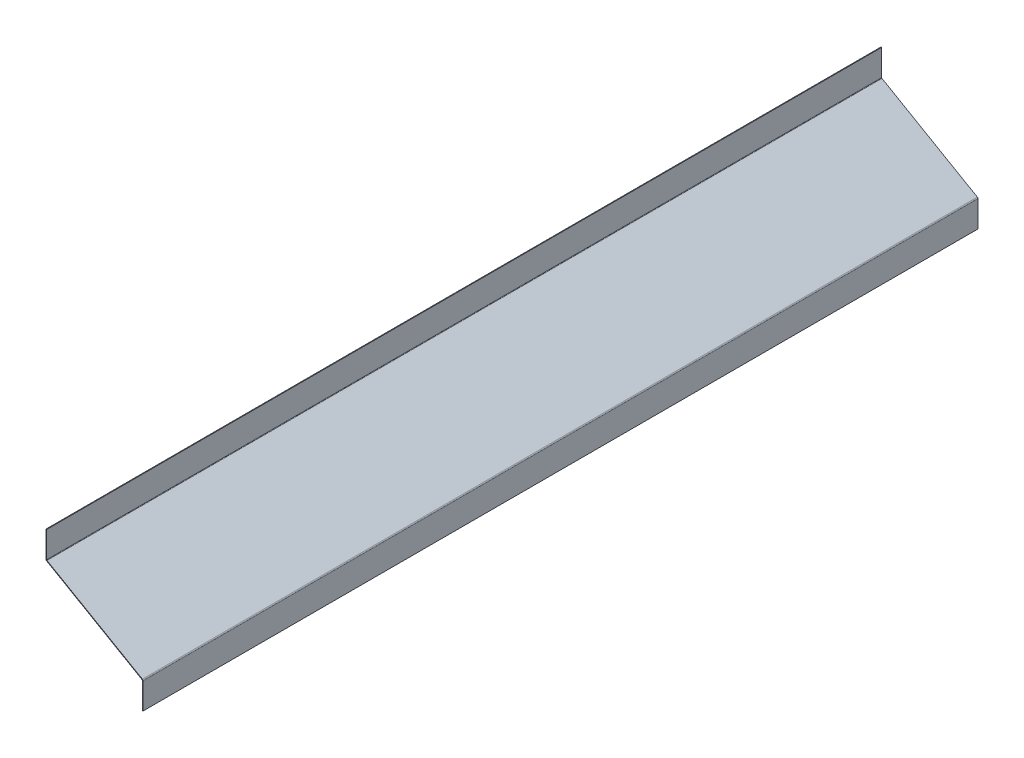
ISO-10303-21;
HEADER;
FILE_DESCRIPTION(('STEP AP214'),'2;1');
FILE_NAME('part.step','',(''),(''),'','','');
FILE_SCHEMA(('AUTOMOTIVE_DESIGN { 1 0 10303 214 1 1 1 1 }'));
ENDSEC;
DATA;
#1=APPLICATION_CONTEXT('core data for automotive mechanical design processes');
#2=APPLICATION_PROTOCOL_DEFINITION('international standard','automotive_design',2000,#1);
#3=PRODUCT_CONTEXT('',#1,'mechanical');
#4=PRODUCT('Part','Part','',(#3));
#5=PRODUCT_RELATED_PRODUCT_CATEGORY('part','',(#4));
#6=PRODUCT_DEFINITION_FORMATION('','',#4);
#7=PRODUCT_DEFINITION_CONTEXT('part definition',#1,'design');
#8=PRODUCT_DEFINITION('design','',#6,#7);
#9=PRODUCT_DEFINITION_SHAPE('','',#8);
#10=(LENGTH_UNIT() NAMED_UNIT(*) SI_UNIT(.MILLI.,.METRE.));
#11=(NAMED_UNIT(*) PLANE_ANGLE_UNIT() SI_UNIT($,.RADIAN.));
#12=(NAMED_UNIT(*) SI_UNIT($,.STERADIAN.) SOLID_ANGLE_UNIT());
#13=UNCERTAINTY_MEASURE_WITH_UNIT(LENGTH_MEASURE(1.E-05),#10,'distance_accuracy_value','');
#14=(GEOMETRIC_REPRESENTATION_CONTEXT(3) GLOBAL_UNCERTAINTY_ASSIGNED_CONTEXT((#13)) GLOBAL_UNIT_ASSIGNED_CONTEXT((#10,
#11,#12)) REPRESENTATION_CONTEXT('',''));
#15=CARTESIAN_POINT('',(0.,0.,0.));
#16=DIRECTION('',(0.,0.,1.));
#17=DIRECTION('',(1.,0.,0.));
#18=AXIS2_PLACEMENT_3D('',#15,#16,#17);
#19=CARTESIAN_POINT('',(0.500000000000002,-0.288675134594812,1242.));
#20=DIRECTION('',(0.,0.,1.));
#21=DIRECTION('',(1.,0.,0.));
#22=AXIS2_PLACEMENT_3D('',#19,#20,#21);
#23=PLANE('',#22);
#24=DIRECTION('',(-0.499999999999998,-0.86602540378444,0.));
#25=VECTOR('',#24,1.);
#26=CARTESIAN_POINT('',(0.500000000000002,-0.288675134594812,1242.));
#27=LINE('',#26,#25);
#28=CARTESIAN_POINT('',(0.500000000000002,-0.288675134594812,1242.));
#29=VERTEX_POINT('',#28);
#30=CARTESIAN_POINT('',(0.,-1.15470053837925,1242.));
#31=VERTEX_POINT('',#30);
#32=EDGE_CURVE('E11',#29,#31,#27,.T.);
#33=ORIENTED_EDGE('',*,*,#32,.F.);
#34=CARTESIAN_POINT('',(1.,0.577350269189627,1242.));
#35=DIRECTION('',(0.,0.,-1.));
#36=DIRECTION('',(-1.,0.,0.));
#37=AXIS2_PLACEMENT_3D('',#34,#35,#36);
#38=CIRCLE('',#37,1.);
#39=CARTESIAN_POINT('',(0.,0.577350269189626,1242.));
#40=VERTEX_POINT('',#39);
#41=EDGE_CURVE('E250',#40,#29,#38,.F.);
#42=ORIENTED_EDGE('',*,*,#41,.F.);
#43=DIRECTION('',(1.,0.,0.));
#44=VECTOR('',#43,1.);
#45=CARTESIAN_POINT('',(-1.,0.577350269189626,1242.));
#46=LINE('',#45,#44);
#47=CARTESIAN_POINT('',(-1.,0.577350269189626,1242.));
#48=VERTEX_POINT('',#47);
#49=EDGE_CURVE('E48',#48,#40,#46,.T.);
#50=ORIENTED_EDGE('',*,*,#49,.F.);
#51=CARTESIAN_POINT('',(1.,0.577350269189627,1242.));
#52=DIRECTION('',(0.,0.,1.));
#53=DIRECTION('',(1.,0.,0.));
#54=AXIS2_PLACEMENT_3D('',#51,#52,#53);
#55=CIRCLE('',#54,2.);
#56=EDGE_CURVE('E149',#48,#31,#55,.T.);
#57=ORIENTED_EDGE('',*,*,#56,.T.);
#58=EDGE_LOOP('',(#33,#42,#50,#57));
#59=FACE_BOUND('',#58,.T.);
#60=ADVANCED_FACE('F40',(#59),#23,.T.);
#61=CARTESIAN_POINT('',(-1.,0.577350269189626,1242.));
#62=DIRECTION('',(0.,0.,1.));
#63=DIRECTION('',(1.,0.,0.));
#64=AXIS2_PLACEMENT_3D('',#61,#62,#63);
#65=PLANE('',#64);
#66=DIRECTION('',(0.86602540378444,-0.499999999999998,0.));
#67=VECTOR('',#66,1.);
#68=CARTESIAN_POINT('',(0.,0.,1242.));
#69=LINE('',#68,#67);
#70=CARTESIAN_POINT('',(142.327204326325,-82.17264973081,1242.));
#71=VERTEX_POINT('',#70);
#72=EDGE_CURVE('E143',#29,#71,#69,.T.);
#73=ORIENTED_EDGE('',*,*,#72,.F.);
#74=ORIENTED_EDGE('',*,*,#32,.T.);
#75=DIRECTION('',(0.86602540378444,-0.499999999999998,0.));
#76=VECTOR('',#75,1.);
#77=CARTESIAN_POINT('',(-0.499999999999998,-0.86602540378444,1242.));
#78=LINE('',#77,#76);
#79=CARTESIAN_POINT('',(141.827204326325,-83.0386751345944,1242.));
#80=VERTEX_POINT('',#79);
#81=EDGE_CURVE('E140',#31,#80,#78,.T.);
#82=ORIENTED_EDGE('',*,*,#81,.T.);
#83=DIRECTION('',(0.499999999999998,0.866025403784439,0.));
#84=VECTOR('',#83,1.);
#85=CARTESIAN_POINT('',(141.827204326325,-83.0386751345944,1242.));
#86=LINE('',#85,#84);
#87=EDGE_CURVE('E231',#80,#71,#86,.T.);
#88=ORIENTED_EDGE('',*,*,#87,.T.);
#89=EDGE_LOOP('',(#73,#74,#82,#88));
#90=FACE_BOUND('',#89,.T.);
#91=ADVANCED_FACE('F138',(#90),#65,.T.);
#92=CARTESIAN_POINT('',(0.,0.577350269189626,0.));
#93=DIRECTION('',(0.,0.,-1.));
#94=DIRECTION('',(-1.,0.,0.));
#95=AXIS2_PLACEMENT_3D('',#92,#93,#94);
#96=PLANE('',#95);
#97=DIRECTION('',(-1.,0.,0.));
#98=VECTOR('',#97,1.);
#99=CARTESIAN_POINT('',(0.,0.577350269189626,0.));
#100=LINE('',#99,#98);
#101=CARTESIAN_POINT('',(0.,0.577350269189626,0.));
#102=VERTEX_POINT('',#101);
#103=CARTESIAN_POINT('',(-1.,0.577350269189626,0.));
#104=VERTEX_POINT('',#103);
#105=EDGE_CURVE('E236',#102,#104,#100,.T.);
#106=ORIENTED_EDGE('',*,*,#105,.F.);
#107=CARTESIAN_POINT('',(1.,0.577350269189627,0.));
#108=DIRECTION('',(0.,0.,-1.));
#109=DIRECTION('',(-1.,0.,0.));
#110=AXIS2_PLACEMENT_3D('',#107,#108,#109);
#111=CIRCLE('',#110,1.);
#112=CARTESIAN_POINT('',(0.500000000000002,-0.288675134594812,0.));
#113=VERTEX_POINT('',#112);
#114=EDGE_CURVE('E188',#102,#113,#111,.F.);
#115=ORIENTED_EDGE('',*,*,#114,.T.);
#116=DIRECTION('',(0.499999999999998,0.86602540378444,0.));
#117=VECTOR('',#116,1.);
#118=CARTESIAN_POINT('',(0.,-1.15470053837925,0.));
#119=LINE('',#118,#117);
#120=CARTESIAN_POINT('',(0.,-1.15470053837925,0.));
#121=VERTEX_POINT('',#120);
#122=EDGE_CURVE('E234',#121,#113,#119,.T.);
#123=ORIENTED_EDGE('',*,*,#122,.F.);
#124=CARTESIAN_POINT('',(1.,0.577350269189627,0.));
#125=DIRECTION('',(0.,0.,1.));
#126=DIRECTION('',(1.,0.,0.));
#127=AXIS2_PLACEMENT_3D('',#124,#125,#126);
#128=CIRCLE('',#127,2.);
#129=EDGE_CURVE('E161',#104,#121,#128,.T.);
#130=ORIENTED_EDGE('',*,*,#129,.F.);
#131=EDGE_LOOP('',(#106,#115,#123,#130));
#132=FACE_BOUND('',#131,.T.);
#133=ADVANCED_FACE('F288',(#132),#96,.T.);
#134=CARTESIAN_POINT('',(0.,-1.15470053837925,0.));
#135=DIRECTION('',(0.,0.,-1.));
#136=DIRECTION('',(-1.,0.,0.));
#137=AXIS2_PLACEMENT_3D('',#134,#135,#136);
#138=PLANE('',#137);
#139=DIRECTION('',(0.,-1.,0.));
#140=VECTOR('',#139,1.);
#141=CARTESIAN_POINT('',(0.,39.5,0.));
#142=LINE('',#141,#140);
#143=CARTESIAN_POINT('',(0.,39.5,0.));
#144=VERTEX_POINT('',#143);
#145=EDGE_CURVE('E191',#144,#102,#142,.T.);
#146=ORIENTED_EDGE('',*,*,#145,.T.);
#147=ORIENTED_EDGE('',*,*,#105,.T.);
#148=DIRECTION('',(0.,-1.,0.));
#149=VECTOR('',#148,1.);
#150=CARTESIAN_POINT('',(-1.,39.5,0.));
#151=LINE('',#150,#149);
#152=CARTESIAN_POINT('',(-1.,39.5,0.));
#153=VERTEX_POINT('',#152);
#154=EDGE_CURVE('E197',#153,#104,#151,.T.);
#155=ORIENTED_EDGE('',*,*,#154,.F.);
#156=DIRECTION('',(1.,0.,0.));
#157=VECTOR('',#156,1.);
#158=CARTESIAN_POINT('',(-1.,39.5,0.));
#159=LINE('',#158,#157);
#160=EDGE_CURVE('E194',#153,#144,#159,.T.);
#161=ORIENTED_EDGE('',*,*,#160,.T.);
#162=EDGE_LOOP('',(#146,#147,#155,#161));
#163=FACE_BOUND('',#162,.T.);
#164=ADVANCED_FACE('F291',(#163),#138,.T.);
#165=CARTESIAN_POINT('',(143.327204326325,-83.9047005383789,1242.));
#166=DIRECTION('',(0.,0.,1.));
#167=DIRECTION('',(1.,0.,0.));
#168=AXIS2_PLACEMENT_3D('',#165,#166,#167);
#169=PLANE('',#168);
#170=DIRECTION('',(-1.,0.,0.));
#171=VECTOR('',#170,1.);
#172=CARTESIAN_POINT('',(143.327204326325,-83.9047005383789,1242.));
#173=LINE('',#172,#171);
#174=CARTESIAN_POINT('',(143.327204326325,-83.9047005383789,1242.));
#175=VERTEX_POINT('',#174);
#176=CARTESIAN_POINT('',(142.327204326325,-83.9047005383789,1242.));
#177=VERTEX_POINT('',#176);
#178=EDGE_CURVE('E56',#175,#177,#173,.T.);
#179=ORIENTED_EDGE('',*,*,#178,.F.);
#180=CARTESIAN_POINT('',(141.327204326325,-83.9047005383789,1242.));
#181=DIRECTION('',(0.,0.,1.));
#182=DIRECTION('',(1.,0.,0.));
#183=AXIS2_PLACEMENT_3D('',#180,#181,#182);
#184=CIRCLE('',#183,2.);
#185=EDGE_CURVE('E260',#71,#175,#184,.F.);
#186=ORIENTED_EDGE('',*,*,#185,.F.);
#187=ORIENTED_EDGE('',*,*,#87,.F.);
#188=CARTESIAN_POINT('',(141.327204326325,-83.9047005383789,1242.));
#189=DIRECTION('',(0.,0.,1.));
#190=DIRECTION('',(1.,0.,0.));
#191=AXIS2_PLACEMENT_3D('',#188,#189,#190);
#192=CIRCLE('',#191,1.);
#193=EDGE_CURVE('E169',#80,#177,#192,.F.);
#194=ORIENTED_EDGE('',*,*,#193,.T.);
#195=EDGE_LOOP('',(#179,#186,#187,#194));
#196=FACE_BOUND('',#195,.T.);
#197=ADVANCED_FACE('F283',(#196),#169,.T.);
#198=CARTESIAN_POINT('',(141.827204326325,-83.0386751345944,1242.));
#199=DIRECTION('',(0.,0.,1.));
#200=DIRECTION('',(1.,0.,0.));
#201=AXIS2_PLACEMENT_3D('',#198,#199,#200);
#202=PLANE('',#201);
#203=DIRECTION('',(0.,-1.,0.));
#204=VECTOR('',#203,1.);
#205=CARTESIAN_POINT('',(143.327204326325,-82.7499999999996,1242.));
#206=LINE('',#205,#204);
#207=CARTESIAN_POINT('',(143.327204326325,-122.78,1242.));
#208=VERTEX_POINT('',#207);
#209=EDGE_CURVE('E263',#175,#208,#206,.T.);
#210=ORIENTED_EDGE('',*,*,#209,.F.);
#211=ORIENTED_EDGE('',*,*,#178,.T.);
#212=DIRECTION('',(0.,1.,0.));
#213=VECTOR('',#212,1.);
#214=CARTESIAN_POINT('',(142.327204326325,-82.7499999999996,1242.));
#215=LINE('',#214,#213);
#216=CARTESIAN_POINT('',(142.327204326325,-122.78,1242.));
#217=VERTEX_POINT('',#216);
#218=EDGE_CURVE('E110',#177,#217,#215,.F.);
#219=ORIENTED_EDGE('',*,*,#218,.T.);
#220=DIRECTION('',(-1.,0.,0.));
#221=VECTOR('',#220,1.);
#222=CARTESIAN_POINT('',(143.327204326325,-122.78,1242.));
#223=LINE('',#222,#221);
#224=EDGE_CURVE('E266',#208,#217,#223,.T.);
#225=ORIENTED_EDGE('',*,*,#224,.F.);
#226=EDGE_LOOP('',(#210,#211,#219,#225));
#227=FACE_BOUND('',#226,.T.);
#228=ADVANCED_FACE('F272',(#227),#202,.T.);
#229=CARTESIAN_POINT('',(142.327204326325,-82.17264973081,0.));
#230=DIRECTION('',(0.,0.,-1.));
#231=DIRECTION('',(-1.,0.,0.));
#232=AXIS2_PLACEMENT_3D('',#229,#230,#231);
#233=PLANE('',#232);
#234=DIRECTION('',(-0.499999999999998,-0.866025403784439,0.));
#235=VECTOR('',#234,1.);
#236=CARTESIAN_POINT('',(142.327204326325,-82.17264973081,0.));
#237=LINE('',#236,#235);
#238=CARTESIAN_POINT('',(142.327204326325,-82.17264973081,0.));
#239=VERTEX_POINT('',#238);
#240=CARTESIAN_POINT('',(141.827204326325,-83.0386751345944,0.));
#241=VERTEX_POINT('',#240);
#242=EDGE_CURVE('E97',#239,#241,#237,.T.);
#243=ORIENTED_EDGE('',*,*,#242,.F.);
#244=CARTESIAN_POINT('',(141.327204326325,-83.9047005383789,0.));
#245=DIRECTION('',(0.,0.,1.));
#246=DIRECTION('',(1.,0.,0.));
#247=AXIS2_PLACEMENT_3D('',#244,#245,#246);
#248=CIRCLE('',#247,2.);
#249=CARTESIAN_POINT('',(143.327204326325,-83.9047005383789,0.));
#250=VERTEX_POINT('',#249);
#251=EDGE_CURVE('E184',#239,#250,#248,.F.);
#252=ORIENTED_EDGE('',*,*,#251,.T.);
#253=DIRECTION('',(1.,0.,0.));
#254=VECTOR('',#253,1.);
#255=CARTESIAN_POINT('',(142.327204326325,-83.9047005383789,0.));
#256=LINE('',#255,#254);
#257=CARTESIAN_POINT('',(142.327204326325,-83.9047005383789,0.));
#258=VERTEX_POINT('',#257);
#259=EDGE_CURVE('E104',#258,#250,#256,.T.);
#260=ORIENTED_EDGE('',*,*,#259,.F.);
#261=CARTESIAN_POINT('',(141.327204326325,-83.9047005383789,0.));
#262=DIRECTION('',(0.,0.,1.));
#263=DIRECTION('',(1.,0.,0.));
#264=AXIS2_PLACEMENT_3D('',#261,#262,#263);
#265=CIRCLE('',#264,1.);
#266=EDGE_CURVE('E203',#241,#258,#265,.F.);
#267=ORIENTED_EDGE('',*,*,#266,.F.);
#268=EDGE_LOOP('',(#243,#252,#260,#267));
#269=FACE_BOUND('',#268,.T.);
#270=ADVANCED_FACE('F320',(#269),#233,.T.);
#271=CARTESIAN_POINT('',(142.327204326325,-83.9047005383789,0.));
#272=DIRECTION('',(0.,0.,-1.));
#273=DIRECTION('',(-1.,0.,0.));
#274=AXIS2_PLACEMENT_3D('',#271,#272,#273);
#275=PLANE('',#274);
#276=DIRECTION('',(0.86602540378444,-0.499999999999998,0.));
#277=VECTOR('',#276,1.);
#278=CARTESIAN_POINT('',(0.,0.,0.));
#279=LINE('',#278,#277);
#280=EDGE_CURVE('E186',#113,#239,#279,.T.);
#281=ORIENTED_EDGE('',*,*,#280,.T.);
#282=ORIENTED_EDGE('',*,*,#242,.T.);
#283=DIRECTION('',(0.86602540378444,-0.499999999999998,0.));
#284=VECTOR('',#283,1.);
#285=CARTESIAN_POINT('',(-0.499999999999998,-0.86602540378444,0.));
#286=LINE('',#285,#284);
#287=EDGE_CURVE('E201',#121,#241,#286,.T.);
#288=ORIENTED_EDGE('',*,*,#287,.F.);
#289=ORIENTED_EDGE('',*,*,#122,.T.);
#290=EDGE_LOOP('',(#281,#282,#288,#289));
#291=FACE_BOUND('',#290,.T.);
#292=ADVANCED_FACE('F323',(#291),#275,.T.);
#293=CARTESIAN_POINT('',(142.327204326325,-82.7499999999996,1242.));
#294=DIRECTION('',(1.,0.,0.));
#295=DIRECTION('',(0.,0.,-1.));
#296=AXIS2_PLACEMENT_3D('',#293,#294,#295);
#297=PLANE('',#296);
#298=DIRECTION('',(0.,1.,0.));
#299=VECTOR('',#298,1.);
#300=CARTESIAN_POINT('',(142.327204326325,-82.7499999999996,0.));
#301=LINE('',#300,#299);
#302=CARTESIAN_POINT('',(142.327204326325,-122.78,0.));
#303=VERTEX_POINT('',#302);
#304=EDGE_CURVE('E175',#258,#303,#301,.F.);
#305=ORIENTED_EDGE('',*,*,#304,.T.);
#306=DIRECTION('',(0.,0.,-1.));
#307=VECTOR('',#306,1.);
#308=CARTESIAN_POINT('',(142.327204326325,-122.78,1242.));
#309=LINE('',#308,#307);
#310=EDGE_CURVE('E227',#217,#303,#309,.T.);
#311=ORIENTED_EDGE('',*,*,#310,.F.);
#312=ORIENTED_EDGE('',*,*,#218,.F.);
#313=DIRECTION('',(0.,0.,-1.));
#314=VECTOR('',#313,1.);
#315=CARTESIAN_POINT('',(142.327204326325,-83.9047005383789,1242.));
#316=LINE('',#315,#314);
#317=EDGE_CURVE('E171',#177,#258,#316,.T.);
#318=ORIENTED_EDGE('',*,*,#317,.T.);
#319=EDGE_LOOP('',(#305,#311,#312,#318));
#320=FACE_BOUND('',#319,.T.);
#321=ADVANCED_FACE('F326',(#320),#297,.F.);
#322=CARTESIAN_POINT('',(143.327204326325,-122.78,1242.));
#323=DIRECTION('',(0.,-1.,0.));
#324=DIRECTION('',(0.,0.,-1.));
#325=AXIS2_PLACEMENT_3D('',#322,#323,#324);
#326=PLANE('',#325);
#327=DIRECTION('',(-1.,0.,0.));
#328=VECTOR('',#327,1.);
#329=CARTESIAN_POINT('',(143.327204326325,-122.78,0.));
#330=LINE('',#329,#328);
#331=CARTESIAN_POINT('',(143.327204326325,-122.78,0.));
#332=VERTEX_POINT('',#331);
#333=EDGE_CURVE('E178',#332,#303,#330,.T.);
#334=ORIENTED_EDGE('',*,*,#333,.F.);
#335=DIRECTION('',(0.,0.,-1.));
#336=VECTOR('',#335,1.);
#337=CARTESIAN_POINT('',(143.327204326325,-122.78,1242.));
#338=LINE('',#337,#336);
#339=EDGE_CURVE('E225',#208,#332,#338,.T.);
#340=ORIENTED_EDGE('',*,*,#339,.F.);
#341=ORIENTED_EDGE('',*,*,#224,.T.);
#342=ORIENTED_EDGE('',*,*,#310,.T.);
#343=EDGE_LOOP('',(#334,#340,#341,#342));
#344=FACE_BOUND('',#343,.T.);
#345=ADVANCED_FACE('F271',(#344),#326,.T.);
#346=CARTESIAN_POINT('',(143.327204326325,-82.7499999999996,1242.));
#347=DIRECTION('',(1.,0.,0.));
#348=DIRECTION('',(0.,0.,-1.));
#349=AXIS2_PLACEMENT_3D('',#346,#347,#348);
#350=PLANE('',#349);
#351=DIRECTION('',(0.,-1.,0.));
#352=VECTOR('',#351,1.);
#353=CARTESIAN_POINT('',(143.327204326325,-82.7499999999996,0.));
#354=LINE('',#353,#352);
#355=EDGE_CURVE('E181',#250,#332,#354,.T.);
#356=ORIENTED_EDGE('',*,*,#355,.F.);
#357=DIRECTION('',(0.,0.,-1.));
#358=VECTOR('',#357,1.);
#359=CARTESIAN_POINT('',(143.327204326325,-83.9047005383789,1242.));
#360=LINE('',#359,#358);
#361=EDGE_CURVE('E222',#175,#250,#360,.T.);
#362=ORIENTED_EDGE('',*,*,#361,.F.);
#363=ORIENTED_EDGE('',*,*,#209,.T.);
#364=ORIENTED_EDGE('',*,*,#339,.T.);
#365=EDGE_LOOP('',(#356,#362,#363,#364));
#366=FACE_BOUND('',#365,.T.);
#367=ADVANCED_FACE('F276',(#366),#350,.T.);
#368=CARTESIAN_POINT('',(141.327204326325,-83.9047005383789,1242.));
#369=DIRECTION('',(0.,0.,-1.));
#370=DIRECTION('',(-1.,0.,0.));
#371=AXIS2_PLACEMENT_3D('',#368,#369,#370);
#372=CYLINDRICAL_SURFACE('',#371,2.);
#373=ORIENTED_EDGE('',*,*,#251,.F.);
#374=DIRECTION('',(0.,0.,-1.));
#375=VECTOR('',#374,1.);
#376=CARTESIAN_POINT('',(142.327204326325,-82.17264973081,1242.));
#377=LINE('',#376,#375);
#378=EDGE_CURVE('E219',#71,#239,#377,.T.);
#379=ORIENTED_EDGE('',*,*,#378,.F.);
#380=ORIENTED_EDGE('',*,*,#185,.T.);
#381=ORIENTED_EDGE('',*,*,#361,.T.);
#382=EDGE_LOOP('',(#373,#379,#380,#381));
#383=FACE_BOUND('',#382,.T.);
#384=ADVANCED_FACE('F279',(#383),#372,.T.);
#385=CARTESIAN_POINT('',(0.,0.,1242.));
#386=DIRECTION('',(0.499999999999998,0.86602540378444,0.));
#387=DIRECTION('',(-0.86602540378444,0.499999999999998,0.));
#388=AXIS2_PLACEMENT_3D('',#385,#386,#387);
#389=PLANE('',#388);
#390=ORIENTED_EDGE('',*,*,#280,.F.);
#391=DIRECTION('',(0.,0.,-1.));
#392=VECTOR('',#391,1.);
#393=CARTESIAN_POINT('',(0.500000000000002,-0.288675134594812,1242.));
#394=LINE('',#393,#392);
#395=EDGE_CURVE('E216',#29,#113,#394,.T.);
#396=ORIENTED_EDGE('',*,*,#395,.F.);
#397=ORIENTED_EDGE('',*,*,#72,.T.);
#398=ORIENTED_EDGE('',*,*,#378,.T.);
#399=EDGE_LOOP('',(#390,#396,#397,#398));
#400=FACE_BOUND('',#399,.T.);
#401=ADVANCED_FACE('F286',(#400),#389,.T.);
#402=CARTESIAN_POINT('',(1.,0.577350269189627,1242.));
#403=DIRECTION('',(0.,0.,-1.));
#404=DIRECTION('',(-1.,0.,0.));
#405=AXIS2_PLACEMENT_3D('',#402,#403,#404);
#406=CYLINDRICAL_SURFACE('',#405,1.);
#407=ORIENTED_EDGE('',*,*,#114,.F.);
#408=DIRECTION('',(0.,0.,-1.));
#409=VECTOR('',#408,1.);
#410=CARTESIAN_POINT('',(0.,0.577350269189626,1242.));
#411=LINE('',#410,#409);
#412=EDGE_CURVE('E213',#40,#102,#411,.T.);
#413=ORIENTED_EDGE('',*,*,#412,.F.);
#414=ORIENTED_EDGE('',*,*,#41,.T.);
#415=ORIENTED_EDGE('',*,*,#395,.T.);
#416=EDGE_LOOP('',(#407,#413,#414,#415));
#417=FACE_BOUND('',#416,.T.);
#418=ADVANCED_FACE('F249',(#417),#406,.F.);
#419=CARTESIAN_POINT('',(0.,39.5,1242.));
#420=DIRECTION('',(1.,0.,0.));
#421=DIRECTION('',(0.,1.,0.));
#422=AXIS2_PLACEMENT_3D('',#419,#420,#421);
#423=PLANE('',#422);
#424=ORIENTED_EDGE('',*,*,#145,.F.);
#425=DIRECTION('',(0.,0.,-1.));
#426=VECTOR('',#425,1.);
#427=CARTESIAN_POINT('',(0.,39.5,1242.));
#428=LINE('',#427,#426);
#429=CARTESIAN_POINT('',(0.,39.5,1242.));
#430=VERTEX_POINT('',#429);
#431=EDGE_CURVE('E211',#430,#144,#428,.T.);
#432=ORIENTED_EDGE('',*,*,#431,.F.);
#433=DIRECTION('',(0.,-1.,0.));
#434=VECTOR('',#433,1.);
#435=CARTESIAN_POINT('',(0.,39.5,1242.));
#436=LINE('',#435,#434);
#437=EDGE_CURVE('E243',#430,#40,#436,.T.);
#438=ORIENTED_EDGE('',*,*,#437,.T.);
#439=ORIENTED_EDGE('',*,*,#412,.T.);
#440=EDGE_LOOP('',(#424,#432,#438,#439));
#441=FACE_BOUND('',#440,.T.);
#442=ADVANCED_FACE('F254',(#441),#423,.T.);
#443=CARTESIAN_POINT('',(-1.,39.5,1242.));
#444=DIRECTION('',(0.,1.,0.));
#445=DIRECTION('',(0.,0.,1.));
#446=AXIS2_PLACEMENT_3D('',#443,#444,#445);
#447=PLANE('',#446);
#448=ORIENTED_EDGE('',*,*,#160,.F.);
#449=DIRECTION('',(0.,0.,-1.));
#450=VECTOR('',#449,1.);
#451=CARTESIAN_POINT('',(-1.,39.5,1242.));
#452=LINE('',#451,#450);
#453=CARTESIAN_POINT('',(-1.,39.5,1242.));
#454=VERTEX_POINT('',#453);
#455=EDGE_CURVE('E209',#454,#153,#452,.T.);
#456=ORIENTED_EDGE('',*,*,#455,.F.);
#457=DIRECTION('',(1.,0.,0.));
#458=VECTOR('',#457,1.);
#459=CARTESIAN_POINT('',(-1.,39.5,1242.));
#460=LINE('',#459,#458);
#461=EDGE_CURVE('E255',#454,#430,#460,.T.);
#462=ORIENTED_EDGE('',*,*,#461,.T.);
#463=ORIENTED_EDGE('',*,*,#431,.T.);
#464=EDGE_LOOP('',(#448,#456,#462,#463));
#465=FACE_BOUND('',#464,.T.);
#466=ADVANCED_FACE('F296',(#465),#447,.T.);
#467=CARTESIAN_POINT('',(-1.,39.5,1242.));
#468=DIRECTION('',(1.,0.,0.));
#469=DIRECTION('',(0.,1.,0.));
#470=AXIS2_PLACEMENT_3D('',#467,#468,#469);
#471=PLANE('',#470);
#472=ORIENTED_EDGE('',*,*,#154,.T.);
#473=DIRECTION('',(0.,0.,-1.));
#474=VECTOR('',#473,1.);
#475=CARTESIAN_POINT('',(-1.,0.577350269189626,1242.));
#476=LINE('',#475,#474);
#477=EDGE_CURVE('E163',#48,#104,#476,.T.);
#478=ORIENTED_EDGE('',*,*,#477,.F.);
#479=DIRECTION('',(0.,-1.,0.));
#480=VECTOR('',#479,1.);
#481=CARTESIAN_POINT('',(-1.,39.5,1242.));
#482=LINE('',#481,#480);
#483=EDGE_CURVE('E154',#454,#48,#482,.T.);
#484=ORIENTED_EDGE('',*,*,#483,.F.);
#485=ORIENTED_EDGE('',*,*,#455,.T.);
#486=EDGE_LOOP('',(#472,#478,#484,#485));
#487=FACE_BOUND('',#486,.T.);
#488=ADVANCED_FACE('F294',(#487),#471,.F.);
#489=CARTESIAN_POINT('',(1.,0.577350269189627,1242.));
#490=DIRECTION('',(0.,0.,-1.));
#491=DIRECTION('',(-1.,0.,0.));
#492=AXIS2_PLACEMENT_3D('',#489,#490,#491);
#493=CYLINDRICAL_SURFACE('',#492,2.);
#494=ORIENTED_EDGE('',*,*,#129,.T.);
#495=DIRECTION('',(0.,0.,-1.));
#496=VECTOR('',#495,1.);
#497=CARTESIAN_POINT('',(0.,-1.15470053837925,1242.));
#498=LINE('',#497,#496);
#499=EDGE_CURVE('E158',#31,#121,#498,.T.);
#500=ORIENTED_EDGE('',*,*,#499,.F.);
#501=ORIENTED_EDGE('',*,*,#56,.F.);
#502=ORIENTED_EDGE('',*,*,#477,.T.);
#503=EDGE_LOOP('',(#494,#500,#501,#502));
#504=FACE_BOUND('',#503,.T.);
#505=ADVANCED_FACE('F159',(#504),#493,.T.);
#506=CARTESIAN_POINT('',(-0.499999999999998,-0.86602540378444,1242.));
#507=DIRECTION('',(0.499999999999998,0.86602540378444,0.));
#508=DIRECTION('',(-0.86602540378444,0.499999999999998,0.));
#509=AXIS2_PLACEMENT_3D('',#506,#507,#508);
#510=PLANE('',#509);
#511=ORIENTED_EDGE('',*,*,#287,.T.);
#512=DIRECTION('',(0.,0.,-1.));
#513=VECTOR('',#512,1.);
#514=CARTESIAN_POINT('',(141.827204326325,-83.0386751345944,1242.));
#515=LINE('',#514,#513);
#516=EDGE_CURVE('E164',#80,#241,#515,.T.);
#517=ORIENTED_EDGE('',*,*,#516,.F.);
#518=ORIENTED_EDGE('',*,*,#81,.F.);
#519=ORIENTED_EDGE('',*,*,#499,.T.);
#520=EDGE_LOOP('',(#511,#517,#518,#519));
#521=FACE_BOUND('',#520,.T.);
#522=ADVANCED_FACE('F166',(#521),#510,.F.);
#523=CARTESIAN_POINT('',(141.327204326325,-83.9047005383789,1242.));
#524=DIRECTION('',(0.,0.,-1.));
#525=DIRECTION('',(-1.,0.,0.));
#526=AXIS2_PLACEMENT_3D('',#523,#524,#525);
#527=CYLINDRICAL_SURFACE('',#526,1.);
#528=ORIENTED_EDGE('',*,*,#266,.T.);
#529=ORIENTED_EDGE('',*,*,#317,.F.);
#530=ORIENTED_EDGE('',*,*,#193,.F.);
#531=ORIENTED_EDGE('',*,*,#516,.T.);
#532=EDGE_LOOP('',(#528,#529,#530,#531));
#533=FACE_BOUND('',#532,.T.);
#534=ADVANCED_FACE('F379',(#533),#527,.F.);
#535=CARTESIAN_POINT('',(141.327204326325,-83.9047005383789,1242.));
#536=DIRECTION('',(0.,0.,1.));
#537=DIRECTION('',(1.,0.,0.));
#538=AXIS2_PLACEMENT_3D('',#535,#536,#537);
#539=PLANE('',#538);
#540=ORIENTED_EDGE('',*,*,#483,.T.);
#541=ORIENTED_EDGE('',*,*,#49,.T.);
#542=ORIENTED_EDGE('',*,*,#437,.F.);
#543=ORIENTED_EDGE('',*,*,#461,.F.);
#544=EDGE_LOOP('',(#540,#541,#542,#543));
#545=FACE_BOUND('',#544,.T.);
#546=ADVANCED_FACE('F240',(#545),#539,.T.);
#547=CARTESIAN_POINT('',(141.327204326325,-83.9047005383789,0.));
#548=DIRECTION('',(0.,0.,1.));
#549=DIRECTION('',(1.,0.,0.));
#550=AXIS2_PLACEMENT_3D('',#547,#548,#549);
#551=PLANE('',#550);
#552=ORIENTED_EDGE('',*,*,#304,.F.);
#553=ORIENTED_EDGE('',*,*,#259,.T.);
#554=ORIENTED_EDGE('',*,*,#355,.T.);
#555=ORIENTED_EDGE('',*,*,#333,.T.);
#556=EDGE_LOOP('',(#552,#553,#554,#555));
#557=FACE_BOUND('',#556,.T.);
#558=ADVANCED_FACE('F399',(#557),#551,.F.);
#559=CLOSED_SHELL('',(#60,#91,#133,#164,#197,#228,#270,#292,#321,#345,#367,#384,#401,#418,#442,
#466,#488,#505,#522,#534,#546,#558));
#560=MANIFOLD_SOLID_BREP('B2',#559);
#561=ADVANCED_BREP_SHAPE_REPRESENTATION('',(#18,#560),#14);
#562=SHAPE_DEFINITION_REPRESENTATION(#9,#561);
ENDSEC;
END-ISO-10303-21;
